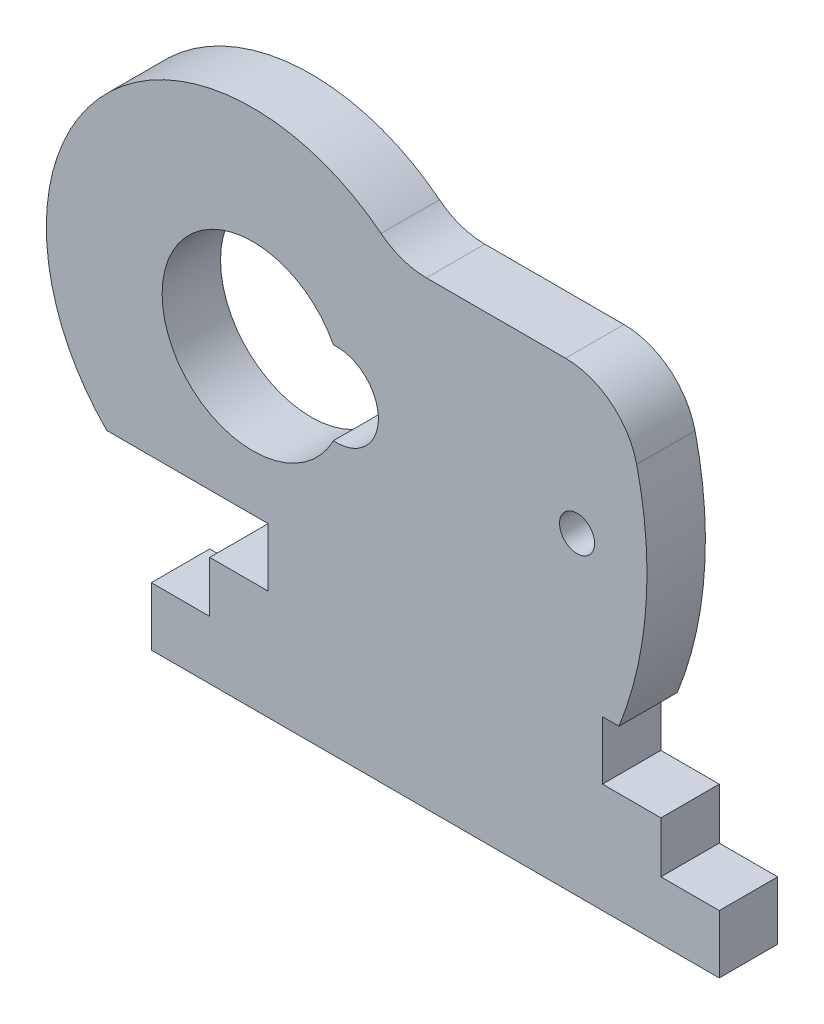
ISO-10303-21;
HEADER;
FILE_DESCRIPTION(('STEP AP214'),'2;1');
FILE_NAME('part.step','',(''),(''),'','','');
FILE_SCHEMA(('AUTOMOTIVE_DESIGN { 1 0 10303 214 1 1 1 1 }'));
ENDSEC;
DATA;
#1=APPLICATION_CONTEXT('core data for automotive mechanical design processes');
#2=APPLICATION_PROTOCOL_DEFINITION('international standard','automotive_design',2000,#1);
#3=PRODUCT_CONTEXT('',#1,'mechanical');
#4=PRODUCT('Part','Part','',(#3));
#5=PRODUCT_RELATED_PRODUCT_CATEGORY('part','',(#4));
#6=PRODUCT_DEFINITION_FORMATION('','',#4);
#7=PRODUCT_DEFINITION_CONTEXT('part definition',#1,'design');
#8=PRODUCT_DEFINITION('design','',#6,#7);
#9=PRODUCT_DEFINITION_SHAPE('','',#8);
#10=(LENGTH_UNIT() NAMED_UNIT(*) SI_UNIT(.MILLI.,.METRE.));
#11=(NAMED_UNIT(*) PLANE_ANGLE_UNIT() SI_UNIT($,.RADIAN.));
#12=(NAMED_UNIT(*) SI_UNIT($,.STERADIAN.) SOLID_ANGLE_UNIT());
#13=UNCERTAINTY_MEASURE_WITH_UNIT(LENGTH_MEASURE(1.E-05),#10,'distance_accuracy_value','');
#14=(GEOMETRIC_REPRESENTATION_CONTEXT(3) GLOBAL_UNCERTAINTY_ASSIGNED_CONTEXT((#13)) GLOBAL_UNIT_ASSIGNED_CONTEXT((#10,
#11,#12)) REPRESENTATION_CONTEXT('',''));
#15=CARTESIAN_POINT('',(0.,0.,0.));
#16=DIRECTION('',(0.,0.,1.));
#17=DIRECTION('',(1.,0.,0.));
#18=AXIS2_PLACEMENT_3D('',#15,#16,#17);
#19=CARTESIAN_POINT('',(0.,7.5,4.));
#20=DIRECTION('',(0.,1.,0.));
#21=DIRECTION('',(0.,0.,1.));
#22=AXIS2_PLACEMENT_3D('',#19,#20,#21);
#23=PLANE('',#22);
#24=DIRECTION('',(1.,0.,0.));
#25=VECTOR('',#24,1.);
#26=CARTESIAN_POINT('',(0.,7.5,0.));
#27=LINE('',#26,#25);
#28=CARTESIAN_POINT('',(4.,7.5,0.));
#29=VERTEX_POINT('',#28);
#30=CARTESIAN_POINT('',(8.,7.5,0.));
#31=VERTEX_POINT('',#30);
#32=EDGE_CURVE('E276',#29,#31,#27,.T.);
#33=ORIENTED_EDGE('',*,*,#32,.F.);
#34=DIRECTION('',(0.,0.,-1.));
#35=VECTOR('',#34,1.);
#36=CARTESIAN_POINT('',(4.,7.5,4.));
#37=LINE('',#36,#35);
#38=CARTESIAN_POINT('',(4.,7.5,4.));
#39=VERTEX_POINT('',#38);
#40=EDGE_CURVE('E380',#39,#29,#37,.T.);
#41=ORIENTED_EDGE('',*,*,#40,.F.);
#42=DIRECTION('',(1.,0.,0.));
#43=VECTOR('',#42,1.);
#44=CARTESIAN_POINT('',(0.,7.5,4.));
#45=LINE('',#44,#43);
#46=CARTESIAN_POINT('',(8.,7.5,4.));
#47=VERTEX_POINT('',#46);
#48=EDGE_CURVE('E203',#39,#47,#45,.T.);
#49=ORIENTED_EDGE('',*,*,#48,.T.);
#50=DIRECTION('',(0.,0.,-1.));
#51=VECTOR('',#50,1.);
#52=CARTESIAN_POINT('',(8.,7.5,4.));
#53=LINE('',#52,#51);
#54=EDGE_CURVE('E198',#47,#31,#53,.T.);
#55=ORIENTED_EDGE('',*,*,#54,.T.);
#56=EDGE_LOOP('',(#33,#41,#49,#55));
#57=FACE_BOUND('',#56,.T.);
#58=ADVANCED_FACE('F41',(#57),#23,.T.);
#59=CARTESIAN_POINT('',(4.,0.,4.));
#60=DIRECTION('',(-1.,0.,0.));
#61=DIRECTION('',(0.,0.,1.));
#62=AXIS2_PLACEMENT_3D('',#59,#60,#61);
#63=PLANE('',#62);
#64=DIRECTION('',(0.,1.,0.));
#65=VECTOR('',#64,1.);
#66=CARTESIAN_POINT('',(4.,0.,0.));
#67=LINE('',#66,#65);
#68=CARTESIAN_POINT('',(4.,4.,0.));
#69=VERTEX_POINT('',#68);
#70=EDGE_CURVE('E280',#69,#29,#67,.T.);
#71=ORIENTED_EDGE('',*,*,#70,.F.);
#72=DIRECTION('',(0.,0.,-1.));
#73=VECTOR('',#72,1.);
#74=CARTESIAN_POINT('',(4.,4.,4.));
#75=LINE('',#74,#73);
#76=CARTESIAN_POINT('',(4.,4.,4.));
#77=VERTEX_POINT('',#76);
#78=EDGE_CURVE('E377',#77,#69,#75,.T.);
#79=ORIENTED_EDGE('',*,*,#78,.F.);
#80=DIRECTION('',(0.,1.,0.));
#81=VECTOR('',#80,1.);
#82=CARTESIAN_POINT('',(4.,0.,4.));
#83=LINE('',#82,#81);
#84=EDGE_CURVE('E207',#77,#39,#83,.T.);
#85=ORIENTED_EDGE('',*,*,#84,.T.);
#86=ORIENTED_EDGE('',*,*,#40,.T.);
#87=EDGE_LOOP('',(#71,#79,#85,#86));
#88=FACE_BOUND('',#87,.T.);
#89=ADVANCED_FACE('F433',(#88),#63,.T.);
#90=CARTESIAN_POINT('',(0.,4.,4.));
#91=DIRECTION('',(0.,1.,0.));
#92=DIRECTION('',(0.,0.,1.));
#93=AXIS2_PLACEMENT_3D('',#90,#91,#92);
#94=PLANE('',#93);
#95=DIRECTION('',(1.,0.,0.));
#96=VECTOR('',#95,1.);
#97=CARTESIAN_POINT('',(0.,4.,0.));
#98=LINE('',#97,#96);
#99=CARTESIAN_POINT('',(0.,4.,0.));
#100=VERTEX_POINT('',#99);
#101=EDGE_CURVE('E284',#100,#69,#98,.T.);
#102=ORIENTED_EDGE('',*,*,#101,.F.);
#103=DIRECTION('',(0.,0.,-1.));
#104=VECTOR('',#103,1.);
#105=CARTESIAN_POINT('',(0.,4.,4.));
#106=LINE('',#105,#104);
#107=CARTESIAN_POINT('',(0.,4.,4.));
#108=VERTEX_POINT('',#107);
#109=EDGE_CURVE('E374',#108,#100,#106,.T.);
#110=ORIENTED_EDGE('',*,*,#109,.F.);
#111=DIRECTION('',(1.,0.,0.));
#112=VECTOR('',#111,1.);
#113=CARTESIAN_POINT('',(0.,4.,4.));
#114=LINE('',#113,#112);
#115=EDGE_CURVE('E213',#108,#77,#114,.T.);
#116=ORIENTED_EDGE('',*,*,#115,.T.);
#117=ORIENTED_EDGE('',*,*,#78,.T.);
#118=EDGE_LOOP('',(#102,#110,#116,#117));
#119=FACE_BOUND('',#118,.T.);
#120=ADVANCED_FACE('F436',(#119),#94,.T.);
#121=CARTESIAN_POINT('',(0.,0.,4.));
#122=DIRECTION('',(-1.,0.,0.));
#123=DIRECTION('',(0.,0.,1.));
#124=AXIS2_PLACEMENT_3D('',#121,#122,#123);
#125=PLANE('',#124);
#126=DIRECTION('',(0.,1.,0.));
#127=VECTOR('',#126,1.);
#128=CARTESIAN_POINT('',(0.,0.,0.));
#129=LINE('',#128,#127);
#130=CARTESIAN_POINT('',(0.,0.,0.));
#131=VERTEX_POINT('',#130);
#132=EDGE_CURVE('E288',#131,#100,#129,.T.);
#133=ORIENTED_EDGE('',*,*,#132,.F.);
#134=DIRECTION('',(0.,0.,-1.));
#135=VECTOR('',#134,1.);
#136=CARTESIAN_POINT('',(0.,0.,4.));
#137=LINE('',#136,#135);
#138=CARTESIAN_POINT('',(0.,0.,4.));
#139=VERTEX_POINT('',#138);
#140=EDGE_CURVE('E371',#139,#131,#137,.T.);
#141=ORIENTED_EDGE('',*,*,#140,.F.);
#142=DIRECTION('',(0.,1.,0.));
#143=VECTOR('',#142,1.);
#144=CARTESIAN_POINT('',(0.,0.,4.));
#145=LINE('',#144,#143);
#146=EDGE_CURVE('E217',#139,#108,#145,.T.);
#147=ORIENTED_EDGE('',*,*,#146,.T.);
#148=ORIENTED_EDGE('',*,*,#109,.T.);
#149=EDGE_LOOP('',(#133,#141,#147,#148));
#150=FACE_BOUND('',#149,.T.);
#151=ADVANCED_FACE('F441',(#150),#125,.T.);
#152=CARTESIAN_POINT('',(0.,0.,4.));
#153=DIRECTION('',(0.,-1.,0.));
#154=DIRECTION('',(0.,0.,-1.));
#155=AXIS2_PLACEMENT_3D('',#152,#153,#154);
#156=PLANE('',#155);
#157=DIRECTION('',(-1.,0.,0.));
#158=VECTOR('',#157,1.);
#159=CARTESIAN_POINT('',(0.,0.,0.));
#160=LINE('',#159,#158);
#161=CARTESIAN_POINT('',(38.9,0.,0.));
#162=VERTEX_POINT('',#161);
#163=EDGE_CURVE('E292',#162,#131,#160,.T.);
#164=ORIENTED_EDGE('',*,*,#163,.F.);
#165=DIRECTION('',(0.,0.,-1.));
#166=VECTOR('',#165,1.);
#167=CARTESIAN_POINT('',(38.9,0.,4.));
#168=LINE('',#167,#166);
#169=CARTESIAN_POINT('',(38.9,0.,4.));
#170=VERTEX_POINT('',#169);
#171=EDGE_CURVE('E368',#170,#162,#168,.T.);
#172=ORIENTED_EDGE('',*,*,#171,.F.);
#173=DIRECTION('',(-1.,0.,0.));
#174=VECTOR('',#173,1.);
#175=CARTESIAN_POINT('',(0.,0.,4.));
#176=LINE('',#175,#174);
#177=EDGE_CURVE('E221',#170,#139,#176,.T.);
#178=ORIENTED_EDGE('',*,*,#177,.T.);
#179=ORIENTED_EDGE('',*,*,#140,.T.);
#180=EDGE_LOOP('',(#164,#172,#178,#179));
#181=FACE_BOUND('',#180,.T.);
#182=ADVANCED_FACE('F444',(#181),#156,.T.);
#183=CARTESIAN_POINT('',(38.9,0.,4.));
#184=DIRECTION('',(1.,0.,0.));
#185=DIRECTION('',(0.,0.,-1.));
#186=AXIS2_PLACEMENT_3D('',#183,#184,#185);
#187=PLANE('',#186);
#188=DIRECTION('',(0.,-1.,0.));
#189=VECTOR('',#188,1.);
#190=CARTESIAN_POINT('',(38.9,0.,0.));
#191=LINE('',#190,#189);
#192=CARTESIAN_POINT('',(38.9,4.,0.));
#193=VERTEX_POINT('',#192);
#194=EDGE_CURVE('E296',#193,#162,#191,.T.);
#195=ORIENTED_EDGE('',*,*,#194,.F.);
#196=DIRECTION('',(0.,0.,-1.));
#197=VECTOR('',#196,1.);
#198=CARTESIAN_POINT('',(38.9,4.,4.));
#199=LINE('',#198,#197);
#200=CARTESIAN_POINT('',(38.9,4.,4.));
#201=VERTEX_POINT('',#200);
#202=EDGE_CURVE('E365',#201,#193,#199,.T.);
#203=ORIENTED_EDGE('',*,*,#202,.F.);
#204=DIRECTION('',(0.,-1.,0.));
#205=VECTOR('',#204,1.);
#206=CARTESIAN_POINT('',(38.9,0.,4.));
#207=LINE('',#206,#205);
#208=EDGE_CURVE('E225',#201,#170,#207,.T.);
#209=ORIENTED_EDGE('',*,*,#208,.T.);
#210=ORIENTED_EDGE('',*,*,#171,.T.);
#211=EDGE_LOOP('',(#195,#203,#209,#210));
#212=FACE_BOUND('',#211,.T.);
#213=ADVANCED_FACE('F449',(#212),#187,.T.);
#214=CARTESIAN_POINT('',(0.,4.,4.));
#215=DIRECTION('',(0.,1.,0.));
#216=DIRECTION('',(0.,0.,1.));
#217=AXIS2_PLACEMENT_3D('',#214,#215,#216);
#218=PLANE('',#217);
#219=DIRECTION('',(1.,0.,0.));
#220=VECTOR('',#219,1.);
#221=CARTESIAN_POINT('',(0.,4.,0.));
#222=LINE('',#221,#220);
#223=CARTESIAN_POINT('',(34.9,4.,0.));
#224=VERTEX_POINT('',#223);
#225=EDGE_CURVE('E300',#224,#193,#222,.T.);
#226=ORIENTED_EDGE('',*,*,#225,.F.);
#227=DIRECTION('',(0.,0.,-1.));
#228=VECTOR('',#227,1.);
#229=CARTESIAN_POINT('',(34.9,4.,4.));
#230=LINE('',#229,#228);
#231=CARTESIAN_POINT('',(34.9,4.,4.));
#232=VERTEX_POINT('',#231);
#233=EDGE_CURVE('E362',#232,#224,#230,.T.);
#234=ORIENTED_EDGE('',*,*,#233,.F.);
#235=DIRECTION('',(1.,0.,0.));
#236=VECTOR('',#235,1.);
#237=CARTESIAN_POINT('',(0.,4.,4.));
#238=LINE('',#237,#236);
#239=EDGE_CURVE('E229',#232,#201,#238,.T.);
#240=ORIENTED_EDGE('',*,*,#239,.T.);
#241=ORIENTED_EDGE('',*,*,#202,.T.);
#242=EDGE_LOOP('',(#226,#234,#240,#241));
#243=FACE_BOUND('',#242,.T.);
#244=ADVANCED_FACE('F452',(#243),#218,.T.);
#245=CARTESIAN_POINT('',(34.9,0.,4.));
#246=DIRECTION('',(1.,0.,0.));
#247=DIRECTION('',(0.,0.,-1.));
#248=AXIS2_PLACEMENT_3D('',#245,#246,#247);
#249=PLANE('',#248);
#250=DIRECTION('',(0.,-1.,0.));
#251=VECTOR('',#250,1.);
#252=CARTESIAN_POINT('',(34.9,0.,0.));
#253=LINE('',#252,#251);
#254=CARTESIAN_POINT('',(34.9,7.5,0.));
#255=VERTEX_POINT('',#254);
#256=EDGE_CURVE('E304',#255,#224,#253,.T.);
#257=ORIENTED_EDGE('',*,*,#256,.F.);
#258=DIRECTION('',(0.,0.,-1.));
#259=VECTOR('',#258,1.);
#260=CARTESIAN_POINT('',(34.9,7.5,4.));
#261=LINE('',#260,#259);
#262=CARTESIAN_POINT('',(34.9,7.5,4.));
#263=VERTEX_POINT('',#262);
#264=EDGE_CURVE('E359',#263,#255,#261,.T.);
#265=ORIENTED_EDGE('',*,*,#264,.F.);
#266=DIRECTION('',(0.,-1.,0.));
#267=VECTOR('',#266,1.);
#268=CARTESIAN_POINT('',(34.9,0.,4.));
#269=LINE('',#268,#267);
#270=EDGE_CURVE('E233',#263,#232,#269,.T.);
#271=ORIENTED_EDGE('',*,*,#270,.T.);
#272=ORIENTED_EDGE('',*,*,#233,.T.);
#273=EDGE_LOOP('',(#257,#265,#271,#272));
#274=FACE_BOUND('',#273,.T.);
#275=ADVANCED_FACE('F457',(#274),#249,.T.);
#276=CARTESIAN_POINT('',(0.,7.5,4.));
#277=DIRECTION('',(0.,1.,0.));
#278=DIRECTION('',(0.,0.,1.));
#279=AXIS2_PLACEMENT_3D('',#276,#277,#278);
#280=PLANE('',#279);
#281=DIRECTION('',(1.,0.,0.));
#282=VECTOR('',#281,1.);
#283=CARTESIAN_POINT('',(0.,7.5,0.));
#284=LINE('',#283,#282);
#285=CARTESIAN_POINT('',(30.9,7.5,0.));
#286=VERTEX_POINT('',#285);
#287=EDGE_CURVE('E308',#286,#255,#284,.T.);
#288=ORIENTED_EDGE('',*,*,#287,.F.);
#289=DIRECTION('',(0.,0.,-1.));
#290=VECTOR('',#289,1.);
#291=CARTESIAN_POINT('',(30.9,7.5,4.));
#292=LINE('',#291,#290);
#293=CARTESIAN_POINT('',(30.9,7.5,4.));
#294=VERTEX_POINT('',#293);
#295=EDGE_CURVE('E356',#294,#286,#292,.T.);
#296=ORIENTED_EDGE('',*,*,#295,.F.);
#297=DIRECTION('',(1.,0.,0.));
#298=VECTOR('',#297,1.);
#299=CARTESIAN_POINT('',(0.,7.5,4.));
#300=LINE('',#299,#298);
#301=EDGE_CURVE('E237',#294,#263,#300,.T.);
#302=ORIENTED_EDGE('',*,*,#301,.T.);
#303=ORIENTED_EDGE('',*,*,#264,.T.);
#304=EDGE_LOOP('',(#288,#296,#302,#303));
#305=FACE_BOUND('',#304,.T.);
#306=ADVANCED_FACE('F460',(#305),#280,.T.);
#307=CARTESIAN_POINT('',(30.9,0.,4.));
#308=DIRECTION('',(1.,0.,0.));
#309=DIRECTION('',(0.,0.,-1.));
#310=AXIS2_PLACEMENT_3D('',#307,#308,#309);
#311=PLANE('',#310);
#312=DIRECTION('',(0.,-1.,0.));
#313=VECTOR('',#312,1.);
#314=CARTESIAN_POINT('',(30.9,0.,0.));
#315=LINE('',#314,#313);
#316=CARTESIAN_POINT('',(30.9,11.5,0.));
#317=VERTEX_POINT('',#316);
#318=EDGE_CURVE('E312',#317,#286,#315,.T.);
#319=ORIENTED_EDGE('',*,*,#318,.F.);
#320=DIRECTION('',(0.,0.,-1.));
#321=VECTOR('',#320,1.);
#322=CARTESIAN_POINT('',(30.9,11.5,4.));
#323=LINE('',#322,#321);
#324=CARTESIAN_POINT('',(30.9,11.5,4.));
#325=VERTEX_POINT('',#324);
#326=EDGE_CURVE('E353',#325,#317,#323,.T.);
#327=ORIENTED_EDGE('',*,*,#326,.F.);
#328=DIRECTION('',(0.,-1.,0.));
#329=VECTOR('',#328,1.);
#330=CARTESIAN_POINT('',(30.9,0.,4.));
#331=LINE('',#330,#329);
#332=EDGE_CURVE('E241',#325,#294,#331,.T.);
#333=ORIENTED_EDGE('',*,*,#332,.T.);
#334=ORIENTED_EDGE('',*,*,#295,.T.);
#335=EDGE_LOOP('',(#319,#327,#333,#334));
#336=FACE_BOUND('',#335,.T.);
#337=ADVANCED_FACE('F465',(#336),#311,.T.);
#338=CARTESIAN_POINT('',(0.,11.5,4.));
#339=DIRECTION('',(0.,-1.,0.));
#340=DIRECTION('',(1.,0.,0.));
#341=AXIS2_PLACEMENT_3D('',#338,#339,#340);
#342=PLANE('',#341);
#343=DIRECTION('',(-1.,0.,0.));
#344=VECTOR('',#343,1.);
#345=CARTESIAN_POINT('',(0.,11.5,0.));
#346=LINE('',#345,#344);
#347=CARTESIAN_POINT('',(32.0298724079689,11.5,0.));
#348=VERTEX_POINT('',#347);
#349=EDGE_CURVE('E316',#348,#317,#346,.T.);
#350=ORIENTED_EDGE('',*,*,#349,.F.);
#351=DIRECTION('',(0.,0.,-1.));
#352=VECTOR('',#351,1.);
#353=CARTESIAN_POINT('',(32.0298724079689,11.5,4.));
#354=LINE('',#353,#352);
#355=CARTESIAN_POINT('',(32.0298724079689,11.5,4.));
#356=VERTEX_POINT('',#355);
#357=EDGE_CURVE('E350',#356,#348,#354,.T.);
#358=ORIENTED_EDGE('',*,*,#357,.F.);
#359=DIRECTION('',(-1.,0.,0.));
#360=VECTOR('',#359,1.);
#361=CARTESIAN_POINT('',(0.,11.5,4.));
#362=LINE('',#361,#360);
#363=EDGE_CURVE('E245',#356,#325,#362,.T.);
#364=ORIENTED_EDGE('',*,*,#363,.T.);
#365=ORIENTED_EDGE('',*,*,#326,.T.);
#366=EDGE_LOOP('',(#350,#358,#364,#365));
#367=FACE_BOUND('',#366,.T.);
#368=ADVANCED_FACE('F468',(#367),#342,.T.);
#369=CARTESIAN_POINT('',(6.95000000000001,21.5,4.));
#370=DIRECTION('',(0.,0.,-1.));
#371=DIRECTION('',(-1.,0.,0.));
#372=AXIS2_PLACEMENT_3D('',#369,#370,#371);
#373=CYLINDRICAL_SURFACE('',#372,27.);
#374=CARTESIAN_POINT('',(6.95000000000001,21.5,0.));
#375=DIRECTION('',(0.,0.,1.));
#376=DIRECTION('',(1.,0.,0.));
#377=AXIS2_PLACEMENT_3D('',#374,#375,#376);
#378=CIRCLE('',#377,27.);
#379=CARTESIAN_POINT('',(33.2434410323623,27.6363636363636,0.));
#380=VERTEX_POINT('',#379);
#381=EDGE_CURVE('E320',#348,#380,#378,.T.);
#382=ORIENTED_EDGE('',*,*,#381,.T.);
#383=DIRECTION('',(0.,0.,-1.));
#384=VECTOR('',#383,1.);
#385=CARTESIAN_POINT('',(33.2434410323623,27.6363636363636,4.));
#386=LINE('',#385,#384);
#387=CARTESIAN_POINT('',(33.2434410323623,27.6363636363636,4.));
#388=VERTEX_POINT('',#387);
#389=EDGE_CURVE('E63',#380,#388,#386,.F.);
#390=ORIENTED_EDGE('',*,*,#389,.T.);
#391=CARTESIAN_POINT('',(6.95000000000001,21.5,4.));
#392=DIRECTION('',(0.,0.,1.));
#393=DIRECTION('',(1.,0.,0.));
#394=AXIS2_PLACEMENT_3D('',#391,#392,#393);
#395=CIRCLE('',#394,27.);
#396=EDGE_CURVE('E249',#356,#388,#395,.T.);
#397=ORIENTED_EDGE('',*,*,#396,.F.);
#398=ORIENTED_EDGE('',*,*,#357,.T.);
#399=EDGE_LOOP('',(#382,#390,#397,#398));
#400=FACE_BOUND('',#399,.T.);
#401=ADVANCED_FACE('F473',(#400),#373,.T.);
#402=CARTESIAN_POINT('',(0.,31.5,4.));
#403=DIRECTION('',(0.,1.,0.));
#404=DIRECTION('',(0.,0.,1.));
#405=AXIS2_PLACEMENT_3D('',#402,#403,#404);
#406=PLANE('',#405);
#407=DIRECTION('',(1.,0.,0.));
#408=VECTOR('',#407,1.);
#409=CARTESIAN_POINT('',(0.,31.5,4.));
#410=LINE('',#409,#408);
#411=CARTESIAN_POINT('',(18.8420711500272,31.5,4.));
#412=VERTEX_POINT('',#411);
#413=CARTESIAN_POINT('',(28.3742852856286,31.5,4.));
#414=VERTEX_POINT('',#413);
#415=EDGE_CURVE('E252',#412,#414,#410,.T.);
#416=ORIENTED_EDGE('',*,*,#415,.T.);
#417=DIRECTION('',(0.,0.,1.));
#418=VECTOR('',#417,1.);
#419=CARTESIAN_POINT('',(28.3742852856286,31.5,0.));
#420=LINE('',#419,#418);
#421=CARTESIAN_POINT('',(28.3742852856286,31.5,0.));
#422=VERTEX_POINT('',#421);
#423=EDGE_CURVE('E388',#414,#422,#420,.F.);
#424=ORIENTED_EDGE('',*,*,#423,.T.);
#425=DIRECTION('',(1.,0.,0.));
#426=VECTOR('',#425,1.);
#427=CARTESIAN_POINT('',(0.,31.5,0.));
#428=LINE('',#427,#426);
#429=CARTESIAN_POINT('',(18.8420711500272,31.5,0.));
#430=VERTEX_POINT('',#429);
#431=EDGE_CURVE('E323',#430,#422,#428,.T.);
#432=ORIENTED_EDGE('',*,*,#431,.F.);
#433=DIRECTION('',(0.,0.,-1.));
#434=VECTOR('',#433,1.);
#435=CARTESIAN_POINT('',(18.8420711500272,31.5,4.));
#436=LINE('',#435,#434);
#437=EDGE_CURVE('E383',#430,#412,#436,.F.);
#438=ORIENTED_EDGE('',*,*,#437,.T.);
#439=EDGE_LOOP('',(#416,#424,#432,#438));
#440=FACE_BOUND('',#439,.T.);
#441=ADVANCED_FACE('F413',(#440),#406,.T.);
#442=CARTESIAN_POINT('',(6.95000000000001,21.5,4.));
#443=DIRECTION('',(0.,0.,-1.));
#444=DIRECTION('',(-1.,0.,0.));
#445=AXIS2_PLACEMENT_3D('',#442,#443,#444);
#446=CYLINDRICAL_SURFACE('',#445,14.1421356237309);
#447=CARTESIAN_POINT('',(6.95000000000001,21.5,4.));
#448=DIRECTION('',(0.,0.,1.));
#449=DIRECTION('',(1.,0.,0.));
#450=AXIS2_PLACEMENT_3D('',#447,#448,#449);
#451=CIRCLE('',#450,14.1421356237309);
#452=CARTESIAN_POINT('',(15.7358160842956,32.5819418755439,4.));
#453=VERTEX_POINT('',#452);
#454=CARTESIAN_POINT('',(-3.04999999999999,11.5,4.));
#455=VERTEX_POINT('',#454);
#456=EDGE_CURVE('E256',#453,#455,#451,.T.);
#457=ORIENTED_EDGE('',*,*,#456,.F.);
#458=DIRECTION('',(0.,0.,-1.));
#459=VECTOR('',#458,1.);
#460=CARTESIAN_POINT('',(15.7358160842956,32.5819418755439,4.));
#461=LINE('',#460,#459);
#462=CARTESIAN_POINT('',(15.7358160842956,32.5819418755439,0.));
#463=VERTEX_POINT('',#462);
#464=EDGE_CURVE('E400',#453,#463,#461,.T.);
#465=ORIENTED_EDGE('',*,*,#464,.T.);
#466=CARTESIAN_POINT('',(6.95000000000001,21.5,0.));
#467=DIRECTION('',(0.,0.,1.));
#468=DIRECTION('',(1.,0.,0.));
#469=AXIS2_PLACEMENT_3D('',#466,#467,#468);
#470=CIRCLE('',#469,14.1421356237309);
#471=CARTESIAN_POINT('',(-3.04999999999999,11.5,0.));
#472=VERTEX_POINT('',#471);
#473=EDGE_CURVE('E327',#463,#472,#470,.T.);
#474=ORIENTED_EDGE('',*,*,#473,.T.);
#475=DIRECTION('',(0.,0.,-1.));
#476=VECTOR('',#475,1.);
#477=CARTESIAN_POINT('',(-3.04999999999999,11.5,4.));
#478=LINE('',#477,#476);
#479=EDGE_CURVE('E346',#455,#472,#478,.T.);
#480=ORIENTED_EDGE('',*,*,#479,.F.);
#481=EDGE_LOOP('',(#457,#465,#474,#480));
#482=FACE_BOUND('',#481,.T.);
#483=ADVANCED_FACE('F416',(#482),#446,.T.);
#484=CARTESIAN_POINT('',(0.,11.5,4.));
#485=DIRECTION('',(0.,-1.,0.));
#486=DIRECTION('',(1.,0.,0.));
#487=AXIS2_PLACEMENT_3D('',#484,#485,#486);
#488=PLANE('',#487);
#489=DIRECTION('',(-1.,0.,0.));
#490=VECTOR('',#489,1.);
#491=CARTESIAN_POINT('',(0.,11.5,0.));
#492=LINE('',#491,#490);
#493=CARTESIAN_POINT('',(8.,11.5,0.));
#494=VERTEX_POINT('',#493);
#495=EDGE_CURVE('E330',#494,#472,#492,.T.);
#496=ORIENTED_EDGE('',*,*,#495,.F.);
#497=DIRECTION('',(0.,0.,-1.));
#498=VECTOR('',#497,1.);
#499=CARTESIAN_POINT('',(8.,11.5,4.));
#500=LINE('',#499,#498);
#501=CARTESIAN_POINT('',(8.,11.5,4.));
#502=VERTEX_POINT('',#501);
#503=EDGE_CURVE('E343',#502,#494,#500,.T.);
#504=ORIENTED_EDGE('',*,*,#503,.F.);
#505=DIRECTION('',(-1.,0.,0.));
#506=VECTOR('',#505,1.);
#507=CARTESIAN_POINT('',(0.,11.5,4.));
#508=LINE('',#507,#506);
#509=EDGE_CURVE('E259',#502,#455,#508,.T.);
#510=ORIENTED_EDGE('',*,*,#509,.T.);
#511=ORIENTED_EDGE('',*,*,#479,.T.);
#512=EDGE_LOOP('',(#496,#504,#510,#511));
#513=FACE_BOUND('',#512,.T.);
#514=ADVANCED_FACE('F494',(#513),#488,.T.);
#515=CARTESIAN_POINT('',(12.7,21.5,4.));
#516=DIRECTION('',(0.,0.,-1.));
#517=DIRECTION('',(-1.,0.,0.));
#518=AXIS2_PLACEMENT_3D('',#515,#516,#517);
#519=CYLINDRICAL_SURFACE('',#518,2.85);
#520=CARTESIAN_POINT('',(12.7,21.5,0.));
#521=DIRECTION('',(0.,0.,1.));
#522=DIRECTION('',(1.,0.,0.));
#523=AXIS2_PLACEMENT_3D('',#520,#521,#522);
#524=CIRCLE('',#523,2.85);
#525=CARTESIAN_POINT('',(12.4720956521739,24.3408730362763,0.));
#526=VERTEX_POINT('',#525);
#527=CARTESIAN_POINT('',(12.4720956521739,18.6591269637237,0.));
#528=VERTEX_POINT('',#527);
#529=EDGE_CURVE('E193',#526,#528,#524,.F.);
#530=ORIENTED_EDGE('',*,*,#529,.T.);
#531=DIRECTION('',(0.,0.,-1.));
#532=VECTOR('',#531,1.);
#533=CARTESIAN_POINT('',(12.4720956521739,18.6591269637237,4.));
#534=LINE('',#533,#532);
#535=CARTESIAN_POINT('',(12.4720956521739,18.6591269637237,4.));
#536=VERTEX_POINT('',#535);
#537=EDGE_CURVE('E190',#536,#528,#534,.T.);
#538=ORIENTED_EDGE('',*,*,#537,.F.);
#539=CARTESIAN_POINT('',(12.7,21.5,4.));
#540=DIRECTION('',(0.,0.,1.));
#541=DIRECTION('',(1.,0.,0.));
#542=AXIS2_PLACEMENT_3D('',#539,#540,#541);
#543=CIRCLE('',#542,2.85);
#544=CARTESIAN_POINT('',(12.4720956521739,24.3408730362763,4.));
#545=VERTEX_POINT('',#544);
#546=EDGE_CURVE('E180',#545,#536,#543,.F.);
#547=ORIENTED_EDGE('',*,*,#546,.F.);
#548=DIRECTION('',(0.,0.,-1.));
#549=VECTOR('',#548,1.);
#550=CARTESIAN_POINT('',(12.4720956521739,24.3408730362763,4.));
#551=LINE('',#550,#549);
#552=EDGE_CURVE('E199',#545,#526,#551,.T.);
#553=ORIENTED_EDGE('',*,*,#552,.T.);
#554=EDGE_LOOP('',(#530,#538,#547,#553));
#555=FACE_BOUND('',#554,.T.);
#556=ADVANCED_FACE('F191',(#555),#519,.F.);
#557=CARTESIAN_POINT('',(8.,0.,4.));
#558=DIRECTION('',(-1.,0.,0.));
#559=DIRECTION('',(0.,0.,1.));
#560=AXIS2_PLACEMENT_3D('',#557,#558,#559);
#561=PLANE('',#560);
#562=DIRECTION('',(0.,1.,0.));
#563=VECTOR('',#562,1.);
#564=CARTESIAN_POINT('',(8.,0.,0.));
#565=LINE('',#564,#563);
#566=EDGE_CURVE('E334',#31,#494,#565,.T.);
#567=ORIENTED_EDGE('',*,*,#566,.F.);
#568=ORIENTED_EDGE('',*,*,#54,.F.);
#569=DIRECTION('',(0.,1.,0.));
#570=VECTOR('',#569,1.);
#571=CARTESIAN_POINT('',(8.,0.,4.));
#572=LINE('',#571,#570);
#573=EDGE_CURVE('E263',#47,#502,#572,.T.);
#574=ORIENTED_EDGE('',*,*,#573,.T.);
#575=ORIENTED_EDGE('',*,*,#503,.T.);
#576=EDGE_LOOP('',(#567,#568,#574,#575));
#577=FACE_BOUND('',#576,.T.);
#578=ADVANCED_FACE('F425',(#577),#561,.T.);
#579=CARTESIAN_POINT('',(6.95000000000001,21.5,4.));
#580=DIRECTION('',(0.,0.,-1.));
#581=DIRECTION('',(-1.,0.,0.));
#582=AXIS2_PLACEMENT_3D('',#579,#580,#581);
#583=CYLINDRICAL_SURFACE('',#582,6.21);
#584=CARTESIAN_POINT('',(6.95000000000001,21.5,0.));
#585=DIRECTION('',(0.,0.,1.));
#586=DIRECTION('',(1.,0.,0.));
#587=AXIS2_PLACEMENT_3D('',#584,#585,#586);
#588=CIRCLE('',#587,6.21);
#589=EDGE_CURVE('E273',#526,#528,#588,.T.);
#590=ORIENTED_EDGE('',*,*,#589,.F.);
#591=ORIENTED_EDGE('',*,*,#552,.F.);
#592=CARTESIAN_POINT('',(6.95000000000001,21.5,4.));
#593=DIRECTION('',(0.,0.,1.));
#594=DIRECTION('',(1.,0.,0.));
#595=AXIS2_PLACEMENT_3D('',#592,#593,#594);
#596=CIRCLE('',#595,6.21);
#597=EDGE_CURVE('E184',#545,#536,#596,.T.);
#598=ORIENTED_EDGE('',*,*,#597,.T.);
#599=ORIENTED_EDGE('',*,*,#537,.T.);
#600=EDGE_LOOP('',(#590,#591,#598,#599));
#601=FACE_BOUND('',#600,.T.);
#602=ADVANCED_FACE('F201',(#601),#583,.F.);
#603=CARTESIAN_POINT('',(29.16,21.5,4.));
#604=DIRECTION('',(0.,0.,-1.));
#605=DIRECTION('',(-1.,0.,0.));
#606=AXIS2_PLACEMENT_3D('',#603,#604,#605);
#607=CYLINDRICAL_SURFACE('',#606,1.2);
#608=CARTESIAN_POINT('',(29.16,21.5,4.));
#609=DIRECTION('',(0.,0.,1.));
#610=DIRECTION('',(1.,0.,0.));
#611=AXIS2_PLACEMENT_3D('',#608,#609,#610);
#612=CIRCLE('',#611,1.2);
#613=CARTESIAN_POINT('',(30.36,21.5,4.));
#614=VERTEX_POINT('',#613);
#615=EDGE_CURVE('E267',#614,#614,#612,.T.);
#616=ORIENTED_EDGE('',*,*,#615,.T.);
#617=EDGE_LOOP('',(#616));
#618=FACE_BOUND('',#617,.T.);
#619=CARTESIAN_POINT('',(29.16,21.5,0.));
#620=DIRECTION('',(0.,0.,1.));
#621=DIRECTION('',(1.,0.,0.));
#622=AXIS2_PLACEMENT_3D('',#619,#620,#621);
#623=CIRCLE('',#622,1.2);
#624=CARTESIAN_POINT('',(30.36,21.5,0.));
#625=VERTEX_POINT('',#624);
#626=EDGE_CURVE('E187',#625,#625,#623,.T.);
#627=ORIENTED_EDGE('',*,*,#626,.F.);
#628=EDGE_LOOP('',(#627));
#629=FACE_BOUND('',#628,.T.);
#630=ADVANCED_FACE('F492',(#618,#629),#607,.F.);
#631=CARTESIAN_POINT('',(0.,0.,4.));
#632=DIRECTION('',(0.,0.,1.));
#633=DIRECTION('',(1.,0.,0.));
#634=AXIS2_PLACEMENT_3D('',#631,#632,#633);
#635=PLANE('',#634);
#636=ORIENTED_EDGE('',*,*,#546,.T.);
#637=ORIENTED_EDGE('',*,*,#597,.F.);
#638=EDGE_LOOP('',(#636,#637));
#639=FACE_BOUND('',#638,.T.);
#640=ORIENTED_EDGE('',*,*,#396,.T.);
#641=CARTESIAN_POINT('',(28.3742852856286,26.5,4.));
#642=DIRECTION('',(0.,0.,1.));
#643=DIRECTION('',(1.,0.,0.));
#644=AXIS2_PLACEMENT_3D('',#641,#642,#643);
#645=CIRCLE('',#644,5.);
#646=EDGE_CURVE('E397',#388,#414,#645,.T.);
#647=ORIENTED_EDGE('',*,*,#646,.T.);
#648=ORIENTED_EDGE('',*,*,#415,.F.);
#649=CARTESIAN_POINT('',(18.8420711500272,36.5,4.));
#650=DIRECTION('',(0.,0.,1.));
#651=DIRECTION('',(1.,0.,0.));
#652=AXIS2_PLACEMENT_3D('',#649,#650,#651);
#653=CIRCLE('',#652,5.);
#654=EDGE_CURVE('E11',#412,#453,#653,.F.);
#655=ORIENTED_EDGE('',*,*,#654,.T.);
#656=ORIENTED_EDGE('',*,*,#456,.T.);
#657=ORIENTED_EDGE('',*,*,#509,.F.);
#658=ORIENTED_EDGE('',*,*,#573,.F.);
#659=ORIENTED_EDGE('',*,*,#48,.F.);
#660=ORIENTED_EDGE('',*,*,#84,.F.);
#661=ORIENTED_EDGE('',*,*,#115,.F.);
#662=ORIENTED_EDGE('',*,*,#146,.F.);
#663=ORIENTED_EDGE('',*,*,#177,.F.);
#664=ORIENTED_EDGE('',*,*,#208,.F.);
#665=ORIENTED_EDGE('',*,*,#239,.F.);
#666=ORIENTED_EDGE('',*,*,#270,.F.);
#667=ORIENTED_EDGE('',*,*,#301,.F.);
#668=ORIENTED_EDGE('',*,*,#332,.F.);
#669=ORIENTED_EDGE('',*,*,#363,.F.);
#670=EDGE_LOOP('',(#640,#647,#648,#655,#656,#657,#658,#659,#660,#661,#662,#663,#664,#665,#666,
#667,#668,#669));
#671=FACE_BOUND('',#670,.T.);
#672=ORIENTED_EDGE('',*,*,#615,.F.);
#673=EDGE_LOOP('',(#672));
#674=FACE_BOUND('',#673,.T.);
#675=ADVANCED_FACE('F182',(#639,#671,#674),#635,.T.);
#676=CARTESIAN_POINT('',(0.,0.,0.));
#677=DIRECTION('',(0.,0.,1.));
#678=DIRECTION('',(1.,0.,0.));
#679=AXIS2_PLACEMENT_3D('',#676,#677,#678);
#680=PLANE('',#679);
#681=ORIENTED_EDGE('',*,*,#529,.F.);
#682=ORIENTED_EDGE('',*,*,#589,.T.);
#683=EDGE_LOOP('',(#681,#682));
#684=FACE_BOUND('',#683,.T.);
#685=ORIENTED_EDGE('',*,*,#431,.T.);
#686=CARTESIAN_POINT('',(28.3742852856286,26.5,0.));
#687=DIRECTION('',(0.,0.,1.));
#688=DIRECTION('',(1.,0.,0.));
#689=AXIS2_PLACEMENT_3D('',#686,#687,#688);
#690=CIRCLE('',#689,5.);
#691=EDGE_CURVE('E392',#422,#380,#690,.F.);
#692=ORIENTED_EDGE('',*,*,#691,.T.);
#693=ORIENTED_EDGE('',*,*,#381,.F.);
#694=ORIENTED_EDGE('',*,*,#349,.T.);
#695=ORIENTED_EDGE('',*,*,#318,.T.);
#696=ORIENTED_EDGE('',*,*,#287,.T.);
#697=ORIENTED_EDGE('',*,*,#256,.T.);
#698=ORIENTED_EDGE('',*,*,#225,.T.);
#699=ORIENTED_EDGE('',*,*,#194,.T.);
#700=ORIENTED_EDGE('',*,*,#163,.T.);
#701=ORIENTED_EDGE('',*,*,#132,.T.);
#702=ORIENTED_EDGE('',*,*,#101,.T.);
#703=ORIENTED_EDGE('',*,*,#70,.T.);
#704=ORIENTED_EDGE('',*,*,#32,.T.);
#705=ORIENTED_EDGE('',*,*,#566,.T.);
#706=ORIENTED_EDGE('',*,*,#495,.T.);
#707=ORIENTED_EDGE('',*,*,#473,.F.);
#708=CARTESIAN_POINT('',(18.8420711500272,36.5,0.));
#709=DIRECTION('',(0.,0.,1.));
#710=DIRECTION('',(1.,0.,0.));
#711=AXIS2_PLACEMENT_3D('',#708,#709,#710);
#712=CIRCLE('',#711,5.);
#713=EDGE_CURVE('E50',#463,#430,#712,.T.);
#714=ORIENTED_EDGE('',*,*,#713,.T.);
#715=EDGE_LOOP('',(#685,#692,#693,#694,#695,#696,#697,#698,#699,#700,#701,#702,#703,#704,#705,
#706,#707,#714));
#716=FACE_BOUND('',#715,.T.);
#717=ORIENTED_EDGE('',*,*,#626,.T.);
#718=EDGE_LOOP('',(#717));
#719=FACE_BOUND('',#718,.T.);
#720=ADVANCED_FACE('F407',(#684,#716,#719),#680,.F.);
#721=CARTESIAN_POINT('',(28.3742852856286,26.5,4.));
#722=DIRECTION('',(0.,0.,-1.));
#723=DIRECTION('',(-1.,0.,0.));
#724=AXIS2_PLACEMENT_3D('',#721,#722,#723);
#725=CYLINDRICAL_SURFACE('',#724,5.);
#726=ORIENTED_EDGE('',*,*,#646,.F.);
#727=ORIENTED_EDGE('',*,*,#389,.F.);
#728=ORIENTED_EDGE('',*,*,#691,.F.);
#729=ORIENTED_EDGE('',*,*,#423,.F.);
#730=EDGE_LOOP('',(#726,#727,#728,#729));
#731=FACE_BOUND('',#730,.T.);
#732=ADVANCED_FACE('F471',(#731),#725,.T.);
#733=CARTESIAN_POINT('',(18.8420711500272,36.5,4.));
#734=DIRECTION('',(0.,0.,-1.));
#735=DIRECTION('',(-1.,0.,0.));
#736=AXIS2_PLACEMENT_3D('',#733,#734,#735);
#737=CYLINDRICAL_SURFACE('',#736,5.);
#738=ORIENTED_EDGE('',*,*,#654,.F.);
#739=ORIENTED_EDGE('',*,*,#437,.F.);
#740=ORIENTED_EDGE('',*,*,#713,.F.);
#741=ORIENTED_EDGE('',*,*,#464,.F.);
#742=EDGE_LOOP('',(#738,#739,#740,#741));
#743=FACE_BOUND('',#742,.T.);
#744=ADVANCED_FACE('F43',(#743),#737,.F.);
#745=CLOSED_SHELL('',(#58,#89,#120,#151,#182,#213,#244,#275,#306,#337,#368,#401,#441,#483,#514,
#556,#578,#602,#630,#675,#720,#732,#744));
#746=MANIFOLD_SOLID_BREP('B2',#745);
#747=ADVANCED_BREP_SHAPE_REPRESENTATION('',(#18,#746),#14);
#748=SHAPE_DEFINITION_REPRESENTATION(#9,#747);
ENDSEC;
END-ISO-10303-21;
